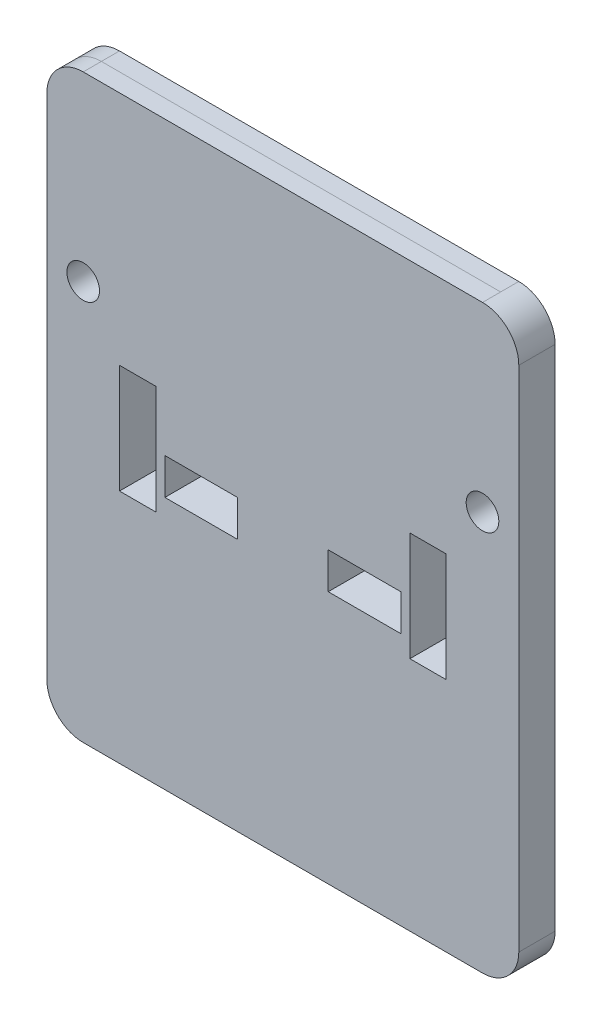
ISO-10303-21;
HEADER;
FILE_DESCRIPTION(('STEP AP214'),'2;1');
FILE_NAME('part.step','',(''),(''),'','','');
FILE_SCHEMA(('AUTOMOTIVE_DESIGN { 1 0 10303 214 1 1 1 1 }'));
ENDSEC;
DATA;
#1=APPLICATION_CONTEXT('core data for automotive mechanical design processes');
#2=APPLICATION_PROTOCOL_DEFINITION('international standard','automotive_design',2000,#1);
#3=PRODUCT_CONTEXT('',#1,'mechanical');
#4=PRODUCT('Part','Part','',(#3));
#5=PRODUCT_RELATED_PRODUCT_CATEGORY('part','',(#4));
#6=PRODUCT_DEFINITION_FORMATION('','',#4);
#7=PRODUCT_DEFINITION_CONTEXT('part definition',#1,'design');
#8=PRODUCT_DEFINITION('design','',#6,#7);
#9=PRODUCT_DEFINITION_SHAPE('','',#8);
#10=(LENGTH_UNIT() NAMED_UNIT(*) SI_UNIT(.MILLI.,.METRE.));
#11=(NAMED_UNIT(*) PLANE_ANGLE_UNIT() SI_UNIT($,.RADIAN.));
#12=(NAMED_UNIT(*) SI_UNIT($,.STERADIAN.) SOLID_ANGLE_UNIT());
#13=UNCERTAINTY_MEASURE_WITH_UNIT(LENGTH_MEASURE(1.E-05),#10,'distance_accuracy_value','');
#14=(GEOMETRIC_REPRESENTATION_CONTEXT(3) GLOBAL_UNCERTAINTY_ASSIGNED_CONTEXT((#13)) GLOBAL_UNIT_ASSIGNED_CONTEXT((#10,
#11,#12)) REPRESENTATION_CONTEXT('',''));
#15=CARTESIAN_POINT('',(0.,0.,0.));
#16=DIRECTION('',(0.,0.,1.));
#17=DIRECTION('',(1.,0.,0.));
#18=AXIS2_PLACEMENT_3D('',#15,#16,#17);
#19=CARTESIAN_POINT('',(-139.7,177.8,25.4));
#20=DIRECTION('',(0.,0.,-1.));
#21=DIRECTION('',(-1.,0.,0.));
#22=AXIS2_PLACEMENT_3D('',#19,#20,#21);
#23=CYLINDRICAL_SURFACE('',#22,25.4);
#24=DIRECTION('',(0.,0.,-1.));
#25=VECTOR('',#24,1.);
#26=CARTESIAN_POINT('',(-139.7,203.2,25.4));
#27=LINE('',#26,#25);
#28=CARTESIAN_POINT('',(-139.7,203.2,25.4));
#29=VERTEX_POINT('',#28);
#30=CARTESIAN_POINT('',(-139.7,203.2,12.7));
#31=VERTEX_POINT('',#30);
#32=EDGE_CURVE('E416',#29,#31,#27,.T.);
#33=ORIENTED_EDGE('',*,*,#32,.T.);
#34=CARTESIAN_POINT('',(-139.7,177.8,12.7));
#35=DIRECTION('',(0.,0.,1.));
#36=DIRECTION('',(1.,0.,0.));
#37=AXIS2_PLACEMENT_3D('',#34,#35,#36);
#38=CIRCLE('',#37,25.4);
#39=CARTESIAN_POINT('',(-165.1,177.8,12.7));
#40=VERTEX_POINT('',#39);
#41=EDGE_CURVE('E12',#31,#40,#38,.T.);
#42=ORIENTED_EDGE('',*,*,#41,.T.);
#43=DIRECTION('',(0.,0.,-1.));
#44=VECTOR('',#43,1.);
#45=CARTESIAN_POINT('',(-165.1,177.8,25.4));
#46=LINE('',#45,#44);
#47=CARTESIAN_POINT('',(-165.1,177.8,25.4));
#48=VERTEX_POINT('',#47);
#49=EDGE_CURVE('E412',#48,#40,#46,.T.);
#50=ORIENTED_EDGE('',*,*,#49,.F.);
#51=CARTESIAN_POINT('',(-139.7,177.8,25.4));
#52=DIRECTION('',(0.,0.,1.));
#53=DIRECTION('',(-1.,0.,0.));
#54=AXIS2_PLACEMENT_3D('',#51,#52,#53);
#55=CIRCLE('',#54,25.4);
#56=EDGE_CURVE('E383',#29,#48,#55,.T.);
#57=ORIENTED_EDGE('',*,*,#56,.F.);
#58=EDGE_LOOP('',(#33,#42,#50,#57));
#59=FACE_BOUND('',#58,.T.);
#60=ADVANCED_FACE('F44',(#59),#23,.T.);
#61=CARTESIAN_POINT('',(-165.1,-177.8,25.4));
#62=DIRECTION('',(1.,0.,0.));
#63=DIRECTION('',(0.,0.,-1.));
#64=AXIS2_PLACEMENT_3D('',#61,#62,#63);
#65=PLANE('',#64);
#66=ORIENTED_EDGE('',*,*,#49,.T.);
#67=DIRECTION('',(0.,-1.,0.));
#68=VECTOR('',#67,1.);
#69=CARTESIAN_POINT('',(-165.1,-177.8,12.7));
#70=LINE('',#69,#68);
#71=CARTESIAN_POINT('',(-165.1,-177.8,12.7));
#72=VERTEX_POINT('',#71);
#73=EDGE_CURVE('E52',#40,#72,#70,.T.);
#74=ORIENTED_EDGE('',*,*,#73,.T.);
#75=DIRECTION('',(0.,0.,-1.));
#76=VECTOR('',#75,1.);
#77=CARTESIAN_POINT('',(-165.1,-177.8,25.4));
#78=LINE('',#77,#76);
#79=CARTESIAN_POINT('',(-165.1,-177.8,25.4));
#80=VERTEX_POINT('',#79);
#81=EDGE_CURVE('E408',#80,#72,#78,.T.);
#82=ORIENTED_EDGE('',*,*,#81,.F.);
#83=DIRECTION('',(0.,-1.,0.));
#84=VECTOR('',#83,1.);
#85=CARTESIAN_POINT('',(-165.1,-177.8,25.4));
#86=LINE('',#85,#84);
#87=EDGE_CURVE('E385',#48,#80,#86,.T.);
#88=ORIENTED_EDGE('',*,*,#87,.F.);
#89=EDGE_LOOP('',(#66,#74,#82,#88));
#90=FACE_BOUND('',#89,.T.);
#91=ADVANCED_FACE('F447',(#90),#65,.F.);
#92=CARTESIAN_POINT('',(-139.7,-177.8,25.4));
#93=DIRECTION('',(0.,0.,-1.));
#94=DIRECTION('',(-1.,0.,0.));
#95=AXIS2_PLACEMENT_3D('',#92,#93,#94);
#96=CYLINDRICAL_SURFACE('',#95,25.4);
#97=ORIENTED_EDGE('',*,*,#81,.T.);
#98=CARTESIAN_POINT('',(-139.7,-177.8,12.7));
#99=DIRECTION('',(0.,0.,1.));
#100=DIRECTION('',(1.,0.,0.));
#101=AXIS2_PLACEMENT_3D('',#98,#99,#100);
#102=CIRCLE('',#101,25.4);
#103=CARTESIAN_POINT('',(-139.7,-203.2,12.7));
#104=VERTEX_POINT('',#103);
#105=EDGE_CURVE('E442',#72,#104,#102,.T.);
#106=ORIENTED_EDGE('',*,*,#105,.T.);
#107=DIRECTION('',(0.,0.,-1.));
#108=VECTOR('',#107,1.);
#109=CARTESIAN_POINT('',(-139.7,-203.2,25.4));
#110=LINE('',#109,#108);
#111=CARTESIAN_POINT('',(-139.7,-203.2,25.4));
#112=VERTEX_POINT('',#111);
#113=EDGE_CURVE('E434',#112,#104,#110,.T.);
#114=ORIENTED_EDGE('',*,*,#113,.F.);
#115=CARTESIAN_POINT('',(-139.7,-177.8,25.4));
#116=DIRECTION('',(0.,0.,1.));
#117=DIRECTION('',(-1.,0.,0.));
#118=AXIS2_PLACEMENT_3D('',#115,#116,#117);
#119=CIRCLE('',#118,25.4);
#120=EDGE_CURVE('E369',#80,#112,#119,.T.);
#121=ORIENTED_EDGE('',*,*,#120,.F.);
#122=EDGE_LOOP('',(#97,#106,#114,#121));
#123=FACE_BOUND('',#122,.T.);
#124=ADVANCED_FACE('F462',(#123),#96,.T.);
#125=CARTESIAN_POINT('',(-139.7,203.2,25.4));
#126=DIRECTION('',(0.,-1.,0.));
#127=DIRECTION('',(0.,0.,-1.));
#128=AXIS2_PLACEMENT_3D('',#125,#126,#127);
#129=PLANE('',#128);
#130=DIRECTION('',(0.,0.,-1.));
#131=VECTOR('',#130,1.);
#132=CARTESIAN_POINT('',(139.7,203.2,25.4));
#133=LINE('',#132,#131);
#134=CARTESIAN_POINT('',(139.7,203.2,25.4));
#135=VERTEX_POINT('',#134);
#136=CARTESIAN_POINT('',(139.7,203.2,12.7));
#137=VERTEX_POINT('',#136);
#138=EDGE_CURVE('E420',#135,#137,#133,.T.);
#139=ORIENTED_EDGE('',*,*,#138,.T.);
#140=DIRECTION('',(-1.,0.,0.));
#141=VECTOR('',#140,1.);
#142=CARTESIAN_POINT('',(-139.7,203.2,12.7));
#143=LINE('',#142,#141);
#144=EDGE_CURVE('E439',#137,#31,#143,.T.);
#145=ORIENTED_EDGE('',*,*,#144,.T.);
#146=ORIENTED_EDGE('',*,*,#32,.F.);
#147=DIRECTION('',(-1.,0.,0.));
#148=VECTOR('',#147,1.);
#149=CARTESIAN_POINT('',(-139.7,203.2,25.4));
#150=LINE('',#149,#148);
#151=EDGE_CURVE('E381',#135,#29,#150,.T.);
#152=ORIENTED_EDGE('',*,*,#151,.F.);
#153=EDGE_LOOP('',(#139,#145,#146,#152));
#154=FACE_BOUND('',#153,.T.);
#155=ADVANCED_FACE('F474',(#154),#129,.F.);
#156=CARTESIAN_POINT('',(-139.7,-203.2,25.4));
#157=DIRECTION('',(0.,1.,0.));
#158=DIRECTION('',(0.,0.,1.));
#159=AXIS2_PLACEMENT_3D('',#156,#157,#158);
#160=PLANE('',#159);
#161=ORIENTED_EDGE('',*,*,#113,.T.);
#162=DIRECTION('',(1.,0.,0.));
#163=VECTOR('',#162,1.);
#164=CARTESIAN_POINT('',(-139.7,-203.2,12.7));
#165=LINE('',#164,#163);
#166=CARTESIAN_POINT('',(139.7,-203.2,12.7));
#167=VERTEX_POINT('',#166);
#168=EDGE_CURVE('E437',#104,#167,#165,.T.);
#169=ORIENTED_EDGE('',*,*,#168,.T.);
#170=DIRECTION('',(0.,0.,-1.));
#171=VECTOR('',#170,1.);
#172=CARTESIAN_POINT('',(139.7,-203.2,25.4));
#173=LINE('',#172,#171);
#174=CARTESIAN_POINT('',(139.7,-203.2,25.4));
#175=VERTEX_POINT('',#174);
#176=EDGE_CURVE('E430',#175,#167,#173,.T.);
#177=ORIENTED_EDGE('',*,*,#176,.F.);
#178=DIRECTION('',(1.,0.,0.));
#179=VECTOR('',#178,1.);
#180=CARTESIAN_POINT('',(-139.7,-203.2,25.4));
#181=LINE('',#180,#179);
#182=EDGE_CURVE('E372',#112,#175,#181,.T.);
#183=ORIENTED_EDGE('',*,*,#182,.F.);
#184=EDGE_LOOP('',(#161,#169,#177,#183));
#185=FACE_BOUND('',#184,.T.);
#186=ADVANCED_FACE('F492',(#185),#160,.F.);
#187=CARTESIAN_POINT('',(-139.7,-177.8,25.4));
#188=DIRECTION('',(0.,0.,-1.));
#189=DIRECTION('',(-1.,0.,0.));
#190=AXIS2_PLACEMENT_3D('',#187,#188,#189);
#191=PLANE('',#190);
#192=DIRECTION('',(0.,-1.,0.));
#193=VECTOR('',#192,1.);
#194=CARTESIAN_POINT('',(114.3,38.0999999999996,25.4));
#195=LINE('',#194,#193);
#196=CARTESIAN_POINT('',(114.3,38.0999999999996,25.4));
#197=VERTEX_POINT('',#196);
#198=CARTESIAN_POINT('',(114.3,-38.1000000000004,25.4));
#199=VERTEX_POINT('',#198);
#200=EDGE_CURVE('E234',#197,#199,#195,.T.);
#201=ORIENTED_EDGE('',*,*,#200,.T.);
#202=DIRECTION('',(-1.,0.,0.));
#203=VECTOR('',#202,1.);
#204=CARTESIAN_POINT('',(114.3,-38.1000000000004,25.4));
#205=LINE('',#204,#203);
#206=CARTESIAN_POINT('',(88.9,-38.1000000000004,25.4));
#207=VERTEX_POINT('',#206);
#208=EDGE_CURVE('E226',#199,#207,#205,.T.);
#209=ORIENTED_EDGE('',*,*,#208,.T.);
#210=DIRECTION('',(0.,1.,0.));
#211=VECTOR('',#210,1.);
#212=CARTESIAN_POINT('',(88.9,-38.1000000000004,25.4));
#213=LINE('',#212,#211);
#214=CARTESIAN_POINT('',(88.9,38.0999999999996,25.4));
#215=VERTEX_POINT('',#214);
#216=EDGE_CURVE('E237',#207,#215,#213,.T.);
#217=ORIENTED_EDGE('',*,*,#216,.T.);
#218=DIRECTION('',(1.,0.,0.));
#219=VECTOR('',#218,1.);
#220=CARTESIAN_POINT('',(88.9,38.0999999999996,25.4));
#221=LINE('',#220,#219);
#222=EDGE_CURVE('E59',#215,#197,#221,.T.);
#223=ORIENTED_EDGE('',*,*,#222,.T.);
#224=EDGE_LOOP('',(#201,#209,#217,#223));
#225=FACE_BOUND('',#224,.T.);
#226=DIRECTION('',(0.,-1.,0.));
#227=VECTOR('',#226,1.);
#228=CARTESIAN_POINT('',(-88.9,38.0999999999999,25.4));
#229=LINE('',#228,#227);
#230=CARTESIAN_POINT('',(-88.9,38.0999999999999,25.4));
#231=VERTEX_POINT('',#230);
#232=CARTESIAN_POINT('',(-88.9,-38.1000000000002,25.4));
#233=VERTEX_POINT('',#232);
#234=EDGE_CURVE('E267',#231,#233,#229,.T.);
#235=ORIENTED_EDGE('',*,*,#234,.T.);
#236=DIRECTION('',(-1.,0.,0.));
#237=VECTOR('',#236,1.);
#238=CARTESIAN_POINT('',(-88.9,-38.1000000000002,25.4));
#239=LINE('',#238,#237);
#240=CARTESIAN_POINT('',(-114.3,-38.1000000000002,25.4));
#241=VERTEX_POINT('',#240);
#242=EDGE_CURVE('E278',#233,#241,#239,.T.);
#243=ORIENTED_EDGE('',*,*,#242,.T.);
#244=DIRECTION('',(0.,1.,0.));
#245=VECTOR('',#244,1.);
#246=CARTESIAN_POINT('',(-114.3,-38.1000000000002,25.4));
#247=LINE('',#246,#245);
#248=CARTESIAN_POINT('',(-114.3,38.0999999999999,25.4));
#249=VERTEX_POINT('',#248);
#250=EDGE_CURVE('E288',#241,#249,#247,.T.);
#251=ORIENTED_EDGE('',*,*,#250,.T.);
#252=DIRECTION('',(1.,0.,0.));
#253=VECTOR('',#252,1.);
#254=CARTESIAN_POINT('',(-114.3,38.0999999999999,25.4));
#255=LINE('',#254,#253);
#256=EDGE_CURVE('E67',#249,#231,#255,.T.);
#257=ORIENTED_EDGE('',*,*,#256,.T.);
#258=EDGE_LOOP('',(#235,#243,#251,#257));
#259=FACE_BOUND('',#258,.T.);
#260=DIRECTION('',(1.,0.,0.));
#261=VECTOR('',#260,1.);
#262=CARTESIAN_POINT('',(31.75,-0.689923182000014,25.4));
#263=LINE('',#262,#261);
#264=CARTESIAN_POINT('',(31.75,-0.689923182000014,25.4));
#265=VERTEX_POINT('',#264);
#266=CARTESIAN_POINT('',(82.55,-0.689923182000014,25.4));
#267=VERTEX_POINT('',#266);
#268=EDGE_CURVE('E303',#265,#267,#263,.T.);
#269=ORIENTED_EDGE('',*,*,#268,.T.);
#270=DIRECTION('',(0.,-1.,0.));
#271=VECTOR('',#270,1.);
#272=CARTESIAN_POINT('',(82.55,-0.689923182000014,25.4));
#273=LINE('',#272,#271);
#274=CARTESIAN_POINT('',(82.55,-26.089923182,25.4));
#275=VERTEX_POINT('',#274);
#276=EDGE_CURVE('E293',#267,#275,#273,.T.);
#277=ORIENTED_EDGE('',*,*,#276,.T.);
#278=DIRECTION('',(-1.,0.,0.));
#279=VECTOR('',#278,1.);
#280=CARTESIAN_POINT('',(82.55,-26.089923182,25.4));
#281=LINE('',#280,#279);
#282=CARTESIAN_POINT('',(31.75,-26.089923182,25.4));
#283=VERTEX_POINT('',#282);
#284=EDGE_CURVE('E296',#275,#283,#281,.T.);
#285=ORIENTED_EDGE('',*,*,#284,.T.);
#286=DIRECTION('',(0.,1.,0.));
#287=VECTOR('',#286,1.);
#288=CARTESIAN_POINT('',(31.75,-26.089923182,25.4));
#289=LINE('',#288,#287);
#290=EDGE_CURVE('E300',#283,#265,#289,.T.);
#291=ORIENTED_EDGE('',*,*,#290,.T.);
#292=EDGE_LOOP('',(#269,#277,#285,#291));
#293=FACE_BOUND('',#292,.T.);
#294=DIRECTION('',(1.,0.,0.));
#295=VECTOR('',#294,1.);
#296=CARTESIAN_POINT('',(-82.55,-0.689923182000014,25.4));
#297=LINE('',#296,#295);
#298=CARTESIAN_POINT('',(-82.55,-0.689923182000014,25.4));
#299=VERTEX_POINT('',#298);
#300=CARTESIAN_POINT('',(-31.75,-0.689923182000014,25.4));
#301=VERTEX_POINT('',#300);
#302=EDGE_CURVE('E330',#299,#301,#297,.T.);
#303=ORIENTED_EDGE('',*,*,#302,.T.);
#304=DIRECTION('',(0.,-1.,0.));
#305=VECTOR('',#304,1.);
#306=CARTESIAN_POINT('',(-31.75,-0.689923182000014,25.4));
#307=LINE('',#306,#305);
#308=CARTESIAN_POINT('',(-31.75,-26.089923182,25.4));
#309=VERTEX_POINT('',#308);
#310=EDGE_CURVE('E340',#301,#309,#307,.T.);
#311=ORIENTED_EDGE('',*,*,#310,.T.);
#312=DIRECTION('',(-1.,0.,0.));
#313=VECTOR('',#312,1.);
#314=CARTESIAN_POINT('',(-31.75,-26.089923182,25.4));
#315=LINE('',#314,#313);
#316=CARTESIAN_POINT('',(-82.55,-26.089923182,25.4));
#317=VERTEX_POINT('',#316);
#318=EDGE_CURVE('E352',#309,#317,#315,.T.);
#319=ORIENTED_EDGE('',*,*,#318,.T.);
#320=DIRECTION('',(0.,1.,0.));
#321=VECTOR('',#320,1.);
#322=CARTESIAN_POINT('',(-82.55,-26.089923182,25.4));
#323=LINE('',#322,#321);
#324=EDGE_CURVE('E349',#317,#299,#323,.T.);
#325=ORIENTED_EDGE('',*,*,#324,.T.);
#326=EDGE_LOOP('',(#303,#311,#319,#325));
#327=FACE_BOUND('',#326,.T.);
#328=ORIENTED_EDGE('',*,*,#120,.T.);
#329=ORIENTED_EDGE('',*,*,#182,.T.);
#330=CARTESIAN_POINT('',(139.7,-177.8,25.4));
#331=DIRECTION('',(0.,0.,1.));
#332=DIRECTION('',(1.,0.,0.));
#333=AXIS2_PLACEMENT_3D('',#330,#331,#332);
#334=CIRCLE('',#333,25.4);
#335=CARTESIAN_POINT('',(165.1,-177.8,25.4));
#336=VERTEX_POINT('',#335);
#337=EDGE_CURVE('E375',#175,#336,#334,.T.);
#338=ORIENTED_EDGE('',*,*,#337,.T.);
#339=DIRECTION('',(0.,1.,0.));
#340=VECTOR('',#339,1.);
#341=CARTESIAN_POINT('',(165.1,-177.8,25.4));
#342=LINE('',#341,#340);
#343=CARTESIAN_POINT('',(165.1,177.8,25.4));
#344=VERTEX_POINT('',#343);
#345=EDGE_CURVE('E377',#336,#344,#342,.T.);
#346=ORIENTED_EDGE('',*,*,#345,.T.);
#347=CARTESIAN_POINT('',(139.7,177.8,25.4));
#348=DIRECTION('',(0.,0.,1.));
#349=DIRECTION('',(-1.,0.,0.));
#350=AXIS2_PLACEMENT_3D('',#347,#348,#349);
#351=CIRCLE('',#350,25.4);
#352=EDGE_CURVE('E379',#344,#135,#351,.T.);
#353=ORIENTED_EDGE('',*,*,#352,.T.);
#354=ORIENTED_EDGE('',*,*,#151,.T.);
#355=ORIENTED_EDGE('',*,*,#56,.T.);
#356=ORIENTED_EDGE('',*,*,#87,.T.);
#357=EDGE_LOOP('',(#328,#329,#338,#346,#353,#354,#355,#356));
#358=FACE_BOUND('',#357,.T.);
#359=CARTESIAN_POINT('',(-139.7,76.2,25.4));
#360=DIRECTION('',(0.,0.,1.));
#361=DIRECTION('',(1.,0.,0.));
#362=AXIS2_PLACEMENT_3D('',#359,#360,#361);
#363=CIRCLE('',#362,11.422);
#364=CARTESIAN_POINT('',(-128.278,76.2,25.4));
#365=VERTEX_POINT('',#364);
#366=EDGE_CURVE('E363',#365,#365,#363,.T.);
#367=ORIENTED_EDGE('',*,*,#366,.F.);
#368=EDGE_LOOP('',(#367));
#369=FACE_BOUND('',#368,.T.);
#370=CARTESIAN_POINT('',(139.7,76.2,25.4));
#371=DIRECTION('',(0.,0.,1.));
#372=DIRECTION('',(1.,0.,0.));
#373=AXIS2_PLACEMENT_3D('',#370,#371,#372);
#374=CIRCLE('',#373,11.422);
#375=CARTESIAN_POINT('',(151.122,76.2,25.4));
#376=VERTEX_POINT('',#375);
#377=EDGE_CURVE('E357',#376,#376,#374,.T.);
#378=ORIENTED_EDGE('',*,*,#377,.F.);
#379=EDGE_LOOP('',(#378));
#380=FACE_BOUND('',#379,.T.);
#381=ADVANCED_FACE('F241',(#225,#259,#293,#327,#358,#369,#380),#191,.F.);
#382=CARTESIAN_POINT('',(-139.7,-177.8,0.));
#383=DIRECTION('',(0.,0.,-1.));
#384=DIRECTION('',(-1.,0.,0.));
#385=AXIS2_PLACEMENT_3D('',#382,#383,#384);
#386=PLANE('',#385);
#387=DIRECTION('',(-1.,0.,0.));
#388=VECTOR('',#387,1.);
#389=CARTESIAN_POINT('',(114.3,-38.1000000000004,0.));
#390=LINE('',#389,#388);
#391=CARTESIAN_POINT('',(114.3,-38.1000000000004,0.));
#392=VERTEX_POINT('',#391);
#393=CARTESIAN_POINT('',(88.9,-38.1000000000004,0.));
#394=VERTEX_POINT('',#393);
#395=EDGE_CURVE('E229',#392,#394,#390,.T.);
#396=ORIENTED_EDGE('',*,*,#395,.F.);
#397=DIRECTION('',(0.,-1.,0.));
#398=VECTOR('',#397,1.);
#399=CARTESIAN_POINT('',(114.3,38.0999999999996,0.));
#400=LINE('',#399,#398);
#401=CARTESIAN_POINT('',(114.3,38.0999999999996,0.));
#402=VERTEX_POINT('',#401);
#403=EDGE_CURVE('E244',#402,#392,#400,.T.);
#404=ORIENTED_EDGE('',*,*,#403,.F.);
#405=DIRECTION('',(1.,0.,0.));
#406=VECTOR('',#405,1.);
#407=CARTESIAN_POINT('',(88.9,38.0999999999996,0.));
#408=LINE('',#407,#406);
#409=CARTESIAN_POINT('',(88.9,38.0999999999996,0.));
#410=VERTEX_POINT('',#409);
#411=EDGE_CURVE('E247',#410,#402,#408,.T.);
#412=ORIENTED_EDGE('',*,*,#411,.F.);
#413=DIRECTION('',(0.,1.,0.));
#414=VECTOR('',#413,1.);
#415=CARTESIAN_POINT('',(88.9,-38.1000000000004,0.));
#416=LINE('',#415,#414);
#417=EDGE_CURVE('E253',#394,#410,#416,.T.);
#418=ORIENTED_EDGE('',*,*,#417,.F.);
#419=EDGE_LOOP('',(#396,#404,#412,#418));
#420=FACE_BOUND('',#419,.T.);
#421=DIRECTION('',(-1.,0.,0.));
#422=VECTOR('',#421,1.);
#423=CARTESIAN_POINT('',(-88.9,-38.1000000000002,0.));
#424=LINE('',#423,#422);
#425=CARTESIAN_POINT('',(-88.9,-38.1000000000002,0.));
#426=VERTEX_POINT('',#425);
#427=CARTESIAN_POINT('',(-114.3,-38.1000000000002,0.));
#428=VERTEX_POINT('',#427);
#429=EDGE_CURVE('E254',#426,#428,#424,.T.);
#430=ORIENTED_EDGE('',*,*,#429,.F.);
#431=DIRECTION('',(0.,-1.,0.));
#432=VECTOR('',#431,1.);
#433=CARTESIAN_POINT('',(-88.9,38.0999999999999,0.));
#434=LINE('',#433,#432);
#435=CARTESIAN_POINT('',(-88.9,38.0999999999999,0.));
#436=VERTEX_POINT('',#435);
#437=EDGE_CURVE('E274',#436,#426,#434,.T.);
#438=ORIENTED_EDGE('',*,*,#437,.F.);
#439=DIRECTION('',(1.,0.,0.));
#440=VECTOR('',#439,1.);
#441=CARTESIAN_POINT('',(-114.3,38.0999999999999,0.));
#442=LINE('',#441,#440);
#443=CARTESIAN_POINT('',(-114.3,38.0999999999999,0.));
#444=VERTEX_POINT('',#443);
#445=EDGE_CURVE('E277',#444,#436,#442,.T.);
#446=ORIENTED_EDGE('',*,*,#445,.F.);
#447=DIRECTION('',(0.,1.,0.));
#448=VECTOR('',#447,1.);
#449=CARTESIAN_POINT('',(-114.3,-38.1000000000002,0.));
#450=LINE('',#449,#448);
#451=EDGE_CURVE('E281',#428,#444,#450,.T.);
#452=ORIENTED_EDGE('',*,*,#451,.F.);
#453=EDGE_LOOP('',(#430,#438,#446,#452));
#454=FACE_BOUND('',#453,.T.);
#455=DIRECTION('',(0.,-1.,0.));
#456=VECTOR('',#455,1.);
#457=CARTESIAN_POINT('',(82.55,-0.689923182000014,0.));
#458=LINE('',#457,#456);
#459=CARTESIAN_POINT('',(82.55,-0.689923182000014,0.));
#460=VERTEX_POINT('',#459);
#461=CARTESIAN_POINT('',(82.55,-26.089923182,0.));
#462=VERTEX_POINT('',#461);
#463=EDGE_CURVE('E307',#460,#462,#458,.T.);
#464=ORIENTED_EDGE('',*,*,#463,.F.);
#465=DIRECTION('',(1.,0.,0.));
#466=VECTOR('',#465,1.);
#467=CARTESIAN_POINT('',(31.75,-0.689923182000014,0.));
#468=LINE('',#467,#466);
#469=CARTESIAN_POINT('',(31.75,-0.689923182000014,0.));
#470=VERTEX_POINT('',#469);
#471=EDGE_CURVE('E297',#470,#460,#468,.T.);
#472=ORIENTED_EDGE('',*,*,#471,.F.);
#473=DIRECTION('',(0.,1.,0.));
#474=VECTOR('',#473,1.);
#475=CARTESIAN_POINT('',(31.75,-26.089923182,0.));
#476=LINE('',#475,#474);
#477=CARTESIAN_POINT('',(31.75,-26.089923182,0.));
#478=VERTEX_POINT('',#477);
#479=EDGE_CURVE('E313',#478,#470,#476,.T.);
#480=ORIENTED_EDGE('',*,*,#479,.F.);
#481=DIRECTION('',(-1.,0.,0.));
#482=VECTOR('',#481,1.);
#483=CARTESIAN_POINT('',(82.55,-26.089923182,0.));
#484=LINE('',#483,#482);
#485=EDGE_CURVE('E309',#462,#478,#484,.T.);
#486=ORIENTED_EDGE('',*,*,#485,.F.);
#487=EDGE_LOOP('',(#464,#472,#480,#486));
#488=FACE_BOUND('',#487,.T.);
#489=DIRECTION('',(0.,-1.,0.));
#490=VECTOR('',#489,1.);
#491=CARTESIAN_POINT('',(-31.75,-0.689923182000014,0.));
#492=LINE('',#491,#490);
#493=CARTESIAN_POINT('',(-31.75,-0.689923182000014,0.));
#494=VERTEX_POINT('',#493);
#495=CARTESIAN_POINT('',(-31.75,-26.089923182,0.));
#496=VERTEX_POINT('',#495);
#497=EDGE_CURVE('E310',#494,#496,#492,.T.);
#498=ORIENTED_EDGE('',*,*,#497,.F.);
#499=DIRECTION('',(1.,0.,0.));
#500=VECTOR('',#499,1.);
#501=CARTESIAN_POINT('',(-82.55,-0.689923182000014,0.));
#502=LINE('',#501,#500);
#503=CARTESIAN_POINT('',(-82.55,-0.689923182000014,0.));
#504=VERTEX_POINT('',#503);
#505=EDGE_CURVE('E336',#504,#494,#502,.T.);
#506=ORIENTED_EDGE('',*,*,#505,.F.);
#507=DIRECTION('',(0.,1.,0.));
#508=VECTOR('',#507,1.);
#509=CARTESIAN_POINT('',(-82.55,-26.089923182,0.));
#510=LINE('',#509,#508);
#511=CARTESIAN_POINT('',(-82.55,-26.089923182,0.));
#512=VERTEX_POINT('',#511);
#513=EDGE_CURVE('E339',#512,#504,#510,.T.);
#514=ORIENTED_EDGE('',*,*,#513,.F.);
#515=DIRECTION('',(-1.,0.,0.));
#516=VECTOR('',#515,1.);
#517=CARTESIAN_POINT('',(-31.75,-26.089923182,0.));
#518=LINE('',#517,#516);
#519=EDGE_CURVE('E343',#496,#512,#518,.T.);
#520=ORIENTED_EDGE('',*,*,#519,.F.);
#521=EDGE_LOOP('',(#498,#506,#514,#520));
#522=FACE_BOUND('',#521,.T.);
#523=CARTESIAN_POINT('',(-139.7,76.2,0.));
#524=DIRECTION('',(0.,0.,1.));
#525=DIRECTION('',(1.,0.,0.));
#526=AXIS2_PLACEMENT_3D('',#523,#524,#525);
#527=CIRCLE('',#526,11.422);
#528=CARTESIAN_POINT('',(-128.278,76.2,0.));
#529=VERTEX_POINT('',#528);
#530=EDGE_CURVE('E360',#529,#529,#527,.T.);
#531=ORIENTED_EDGE('',*,*,#530,.T.);
#532=EDGE_LOOP('',(#531));
#533=FACE_BOUND('',#532,.T.);
#534=CARTESIAN_POINT('',(-139.7,-177.8,0.));
#535=DIRECTION('',(0.,0.,1.));
#536=DIRECTION('',(-1.,0.,0.));
#537=AXIS2_PLACEMENT_3D('',#534,#535,#536);
#538=CIRCLE('',#537,25.4);
#539=CARTESIAN_POINT('',(-165.1,-177.8,0.));
#540=VERTEX_POINT('',#539);
#541=CARTESIAN_POINT('',(-139.7,-203.2,0.));
#542=VERTEX_POINT('',#541);
#543=EDGE_CURVE('E366',#540,#542,#538,.T.);
#544=ORIENTED_EDGE('',*,*,#543,.F.);
#545=DIRECTION('',(0.,-1.,0.));
#546=VECTOR('',#545,1.);
#547=CARTESIAN_POINT('',(-165.1,-177.8,0.));
#548=LINE('',#547,#546);
#549=CARTESIAN_POINT('',(-165.1,177.8,0.));
#550=VERTEX_POINT('',#549);
#551=EDGE_CURVE('E373',#550,#540,#548,.T.);
#552=ORIENTED_EDGE('',*,*,#551,.F.);
#553=CARTESIAN_POINT('',(-139.7,177.8,0.));
#554=DIRECTION('',(0.,0.,1.));
#555=DIRECTION('',(-1.,0.,0.));
#556=AXIS2_PLACEMENT_3D('',#553,#554,#555);
#557=CIRCLE('',#556,25.4);
#558=CARTESIAN_POINT('',(-139.7,203.2,0.));
#559=VERTEX_POINT('',#558);
#560=EDGE_CURVE('E403',#559,#550,#557,.T.);
#561=ORIENTED_EDGE('',*,*,#560,.F.);
#562=DIRECTION('',(-1.,0.,0.));
#563=VECTOR('',#562,1.);
#564=CARTESIAN_POINT('',(-139.7,203.2,0.));
#565=LINE('',#564,#563);
#566=CARTESIAN_POINT('',(139.7,203.2,0.));
#567=VERTEX_POINT('',#566);
#568=EDGE_CURVE('E400',#567,#559,#565,.T.);
#569=ORIENTED_EDGE('',*,*,#568,.F.);
#570=CARTESIAN_POINT('',(139.7,177.8,0.));
#571=DIRECTION('',(0.,0.,1.));
#572=DIRECTION('',(-1.,0.,0.));
#573=AXIS2_PLACEMENT_3D('',#570,#571,#572);
#574=CIRCLE('',#573,25.4);
#575=CARTESIAN_POINT('',(165.1,177.8,0.));
#576=VERTEX_POINT('',#575);
#577=EDGE_CURVE('E397',#576,#567,#574,.T.);
#578=ORIENTED_EDGE('',*,*,#577,.F.);
#579=DIRECTION('',(0.,1.,0.));
#580=VECTOR('',#579,1.);
#581=CARTESIAN_POINT('',(165.1,-177.8,0.));
#582=LINE('',#581,#580);
#583=CARTESIAN_POINT('',(165.1,-177.8,0.));
#584=VERTEX_POINT('',#583);
#585=EDGE_CURVE('E395',#584,#576,#582,.T.);
#586=ORIENTED_EDGE('',*,*,#585,.F.);
#587=CARTESIAN_POINT('',(139.7,-177.8,0.));
#588=DIRECTION('',(0.,0.,1.));
#589=DIRECTION('',(1.,0.,0.));
#590=AXIS2_PLACEMENT_3D('',#587,#588,#589);
#591=CIRCLE('',#590,25.4);
#592=CARTESIAN_POINT('',(139.7,-203.2,0.));
#593=VERTEX_POINT('',#592);
#594=EDGE_CURVE('E393',#593,#584,#591,.T.);
#595=ORIENTED_EDGE('',*,*,#594,.F.);
#596=DIRECTION('',(1.,0.,0.));
#597=VECTOR('',#596,1.);
#598=CARTESIAN_POINT('',(-139.7,-203.2,0.));
#599=LINE('',#598,#597);
#600=EDGE_CURVE('E390',#542,#593,#599,.T.);
#601=ORIENTED_EDGE('',*,*,#600,.F.);
#602=EDGE_LOOP('',(#544,#552,#561,#569,#578,#586,#595,#601));
#603=FACE_BOUND('',#602,.T.);
#604=CARTESIAN_POINT('',(139.7,76.2,0.));
#605=DIRECTION('',(0.,0.,1.));
#606=DIRECTION('',(1.,0.,0.));
#607=AXIS2_PLACEMENT_3D('',#604,#605,#606);
#608=CIRCLE('',#607,11.422);
#609=CARTESIAN_POINT('',(151.122,76.2,0.));
#610=VERTEX_POINT('',#609);
#611=EDGE_CURVE('E320',#610,#610,#608,.T.);
#612=ORIENTED_EDGE('',*,*,#611,.T.);
#613=EDGE_LOOP('',(#612));
#614=FACE_BOUND('',#613,.T.);
#615=ADVANCED_FACE('F483',(#420,#454,#488,#522,#533,#603,#614),#386,.T.);
#616=ORIENTED_EDGE('',*,*,#105,.F.);
#617=EDGE_CURVE('E387',#72,#540,#78,.T.);
#618=ORIENTED_EDGE('',*,*,#617,.T.);
#619=ORIENTED_EDGE('',*,*,#543,.T.);
#620=EDGE_CURVE('E433',#104,#542,#110,.T.);
#621=ORIENTED_EDGE('',*,*,#620,.F.);
#622=EDGE_LOOP('',(#616,#618,#619,#621));
#623=FACE_BOUND('',#622,.T.);
#624=ADVANCED_FACE('F46',(#623),#96,.T.);
#625=ORIENTED_EDGE('',*,*,#168,.F.);
#626=ORIENTED_EDGE('',*,*,#620,.T.);
#627=ORIENTED_EDGE('',*,*,#600,.T.);
#628=EDGE_CURVE('E429',#167,#593,#173,.T.);
#629=ORIENTED_EDGE('',*,*,#628,.F.);
#630=EDGE_LOOP('',(#625,#626,#627,#629));
#631=FACE_BOUND('',#630,.T.);
#632=ADVANCED_FACE('F490',(#631),#160,.F.);
#633=CARTESIAN_POINT('',(139.7,-177.8,25.4));
#634=DIRECTION('',(0.,0.,-1.));
#635=DIRECTION('',(-1.,0.,0.));
#636=AXIS2_PLACEMENT_3D('',#633,#634,#635);
#637=CYLINDRICAL_SURFACE('',#636,25.4);
#638=ORIENTED_EDGE('',*,*,#594,.T.);
#639=DIRECTION('',(0.,0.,-1.));
#640=VECTOR('',#639,1.);
#641=CARTESIAN_POINT('',(165.1,-177.8,25.4));
#642=LINE('',#641,#640);
#643=EDGE_CURVE('E426',#336,#584,#642,.T.);
#644=ORIENTED_EDGE('',*,*,#643,.F.);
#645=ORIENTED_EDGE('',*,*,#337,.F.);
#646=ORIENTED_EDGE('',*,*,#176,.T.);
#647=ORIENTED_EDGE('',*,*,#628,.T.);
#648=EDGE_LOOP('',(#638,#644,#645,#646,#647));
#649=FACE_BOUND('',#648,.T.);
#650=ADVANCED_FACE('F496',(#649),#637,.T.);
#651=CARTESIAN_POINT('',(165.1,-177.8,25.4));
#652=DIRECTION('',(-1.,0.,0.));
#653=DIRECTION('',(0.,0.,1.));
#654=AXIS2_PLACEMENT_3D('',#651,#652,#653);
#655=PLANE('',#654);
#656=ORIENTED_EDGE('',*,*,#585,.T.);
#657=DIRECTION('',(0.,0.,-1.));
#658=VECTOR('',#657,1.);
#659=CARTESIAN_POINT('',(165.1,177.8,25.4));
#660=LINE('',#659,#658);
#661=EDGE_CURVE('E423',#344,#576,#660,.T.);
#662=ORIENTED_EDGE('',*,*,#661,.F.);
#663=ORIENTED_EDGE('',*,*,#345,.F.);
#664=ORIENTED_EDGE('',*,*,#643,.T.);
#665=EDGE_LOOP('',(#656,#662,#663,#664));
#666=FACE_BOUND('',#665,.T.);
#667=ADVANCED_FACE('F501',(#666),#655,.F.);
#668=CARTESIAN_POINT('',(139.7,177.8,25.4));
#669=DIRECTION('',(0.,0.,-1.));
#670=DIRECTION('',(-1.,0.,0.));
#671=AXIS2_PLACEMENT_3D('',#668,#669,#670);
#672=CYLINDRICAL_SURFACE('',#671,25.4);
#673=ORIENTED_EDGE('',*,*,#577,.T.);
#674=EDGE_CURVE('E419',#137,#567,#133,.T.);
#675=ORIENTED_EDGE('',*,*,#674,.F.);
#676=ORIENTED_EDGE('',*,*,#138,.F.);
#677=ORIENTED_EDGE('',*,*,#352,.F.);
#678=ORIENTED_EDGE('',*,*,#661,.T.);
#679=EDGE_LOOP('',(#673,#675,#676,#677,#678));
#680=FACE_BOUND('',#679,.T.);
#681=ADVANCED_FACE('F503',(#680),#672,.T.);
#682=ORIENTED_EDGE('',*,*,#144,.F.);
#683=ORIENTED_EDGE('',*,*,#674,.T.);
#684=ORIENTED_EDGE('',*,*,#568,.T.);
#685=EDGE_CURVE('E415',#31,#559,#27,.T.);
#686=ORIENTED_EDGE('',*,*,#685,.F.);
#687=EDGE_LOOP('',(#682,#683,#684,#686));
#688=FACE_BOUND('',#687,.T.);
#689=ADVANCED_FACE('F478',(#688),#129,.F.);
#690=ORIENTED_EDGE('',*,*,#41,.F.);
#691=ORIENTED_EDGE('',*,*,#685,.T.);
#692=ORIENTED_EDGE('',*,*,#560,.T.);
#693=EDGE_CURVE('E411',#40,#550,#46,.T.);
#694=ORIENTED_EDGE('',*,*,#693,.F.);
#695=EDGE_LOOP('',(#690,#691,#692,#694));
#696=FACE_BOUND('',#695,.T.);
#697=ADVANCED_FACE('F471',(#696),#23,.T.);
#698=ORIENTED_EDGE('',*,*,#73,.F.);
#699=ORIENTED_EDGE('',*,*,#693,.T.);
#700=ORIENTED_EDGE('',*,*,#551,.T.);
#701=ORIENTED_EDGE('',*,*,#617,.F.);
#702=EDGE_LOOP('',(#698,#699,#700,#701));
#703=FACE_BOUND('',#702,.T.);
#704=ADVANCED_FACE('F459',(#703),#65,.F.);
#705=CARTESIAN_POINT('',(-139.7,76.2,25.4));
#706=DIRECTION('',(0.,0.,-1.));
#707=DIRECTION('',(-1.,0.,0.));
#708=AXIS2_PLACEMENT_3D('',#705,#706,#707);
#709=CYLINDRICAL_SURFACE('',#708,11.422);
#710=ORIENTED_EDGE('',*,*,#366,.T.);
#711=EDGE_LOOP('',(#710));
#712=FACE_BOUND('',#711,.T.);
#713=ORIENTED_EDGE('',*,*,#530,.F.);
#714=EDGE_LOOP('',(#713));
#715=FACE_BOUND('',#714,.T.);
#716=ADVANCED_FACE('F524',(#712,#715),#709,.F.);
#717=CARTESIAN_POINT('',(139.7,76.2,25.4));
#718=DIRECTION('',(0.,0.,-1.));
#719=DIRECTION('',(-1.,0.,0.));
#720=AXIS2_PLACEMENT_3D('',#717,#718,#719);
#721=CYLINDRICAL_SURFACE('',#720,11.422);
#722=ORIENTED_EDGE('',*,*,#377,.T.);
#723=EDGE_LOOP('',(#722));
#724=FACE_BOUND('',#723,.T.);
#725=ORIENTED_EDGE('',*,*,#611,.F.);
#726=EDGE_LOOP('',(#725));
#727=FACE_BOUND('',#726,.T.);
#728=ADVANCED_FACE('F529',(#724,#727),#721,.F.);
#729=CARTESIAN_POINT('',(-31.75,-0.689923182000014,25.4));
#730=DIRECTION('',(1.,0.,0.));
#731=DIRECTION('',(0.,0.,-1.));
#732=AXIS2_PLACEMENT_3D('',#729,#730,#731);
#733=PLANE('',#732);
#734=ORIENTED_EDGE('',*,*,#497,.T.);
#735=DIRECTION('',(0.,0.,-1.));
#736=VECTOR('',#735,1.);
#737=CARTESIAN_POINT('',(-31.75,-26.089923182,25.4));
#738=LINE('',#737,#736);
#739=EDGE_CURVE('E327',#309,#496,#738,.T.);
#740=ORIENTED_EDGE('',*,*,#739,.F.);
#741=ORIENTED_EDGE('',*,*,#310,.F.);
#742=DIRECTION('',(0.,0.,-1.));
#743=VECTOR('',#742,1.);
#744=CARTESIAN_POINT('',(-31.75,-0.689923182000014,25.4));
#745=LINE('',#744,#743);
#746=EDGE_CURVE('E260',#301,#494,#745,.T.);
#747=ORIENTED_EDGE('',*,*,#746,.T.);
#748=EDGE_LOOP('',(#734,#740,#741,#747));
#749=FACE_BOUND('',#748,.T.);
#750=ADVANCED_FACE('F539',(#749),#733,.F.);
#751=CARTESIAN_POINT('',(-82.55,-0.689923182000014,25.4));
#752=DIRECTION('',(0.,1.,0.));
#753=DIRECTION('',(0.,0.,1.));
#754=AXIS2_PLACEMENT_3D('',#751,#752,#753);
#755=PLANE('',#754);
#756=ORIENTED_EDGE('',*,*,#505,.T.);
#757=ORIENTED_EDGE('',*,*,#746,.F.);
#758=ORIENTED_EDGE('',*,*,#302,.F.);
#759=DIRECTION('',(0.,0.,-1.));
#760=VECTOR('',#759,1.);
#761=CARTESIAN_POINT('',(-82.55,-0.689923182000014,25.4));
#762=LINE('',#761,#760);
#763=EDGE_CURVE('E333',#299,#504,#762,.T.);
#764=ORIENTED_EDGE('',*,*,#763,.T.);
#765=EDGE_LOOP('',(#756,#757,#758,#764));
#766=FACE_BOUND('',#765,.T.);
#767=ADVANCED_FACE('F541',(#766),#755,.F.);
#768=CARTESIAN_POINT('',(-82.55,-26.089923182,25.4));
#769=DIRECTION('',(-1.,0.,0.));
#770=DIRECTION('',(0.,0.,1.));
#771=AXIS2_PLACEMENT_3D('',#768,#769,#770);
#772=PLANE('',#771);
#773=ORIENTED_EDGE('',*,*,#513,.T.);
#774=ORIENTED_EDGE('',*,*,#763,.F.);
#775=ORIENTED_EDGE('',*,*,#324,.F.);
#776=DIRECTION('',(0.,0.,-1.));
#777=VECTOR('',#776,1.);
#778=CARTESIAN_POINT('',(-82.55,-26.089923182,25.4));
#779=LINE('',#778,#777);
#780=EDGE_CURVE('E331',#317,#512,#779,.T.);
#781=ORIENTED_EDGE('',*,*,#780,.T.);
#782=EDGE_LOOP('',(#773,#774,#775,#781));
#783=FACE_BOUND('',#782,.T.);
#784=ADVANCED_FACE('F544',(#783),#772,.F.);
#785=CARTESIAN_POINT('',(-31.75,-26.089923182,25.4));
#786=DIRECTION('',(0.,-1.,0.));
#787=DIRECTION('',(0.,0.,-1.));
#788=AXIS2_PLACEMENT_3D('',#785,#786,#787);
#789=PLANE('',#788);
#790=ORIENTED_EDGE('',*,*,#519,.T.);
#791=ORIENTED_EDGE('',*,*,#780,.F.);
#792=ORIENTED_EDGE('',*,*,#318,.F.);
#793=ORIENTED_EDGE('',*,*,#739,.T.);
#794=EDGE_LOOP('',(#790,#791,#792,#793));
#795=FACE_BOUND('',#794,.T.);
#796=ADVANCED_FACE('F548',(#795),#789,.F.);
#797=CARTESIAN_POINT('',(82.55,-0.689923182000014,25.4));
#798=DIRECTION('',(1.,0.,0.));
#799=DIRECTION('',(0.,0.,-1.));
#800=AXIS2_PLACEMENT_3D('',#797,#798,#799);
#801=PLANE('',#800);
#802=ORIENTED_EDGE('',*,*,#463,.T.);
#803=DIRECTION('',(0.,0.,-1.));
#804=VECTOR('',#803,1.);
#805=CARTESIAN_POINT('',(82.55,-26.089923182,25.4));
#806=LINE('',#805,#804);
#807=EDGE_CURVE('E306',#275,#462,#806,.T.);
#808=ORIENTED_EDGE('',*,*,#807,.F.);
#809=ORIENTED_EDGE('',*,*,#276,.F.);
#810=DIRECTION('',(0.,0.,-1.));
#811=VECTOR('',#810,1.);
#812=CARTESIAN_POINT('',(82.55,-0.689923182000014,25.4));
#813=LINE('',#812,#811);
#814=EDGE_CURVE('E318',#267,#460,#813,.T.);
#815=ORIENTED_EDGE('',*,*,#814,.T.);
#816=EDGE_LOOP('',(#802,#808,#809,#815));
#817=FACE_BOUND('',#816,.T.);
#818=ADVANCED_FACE('F552',(#817),#801,.F.);
#819=CARTESIAN_POINT('',(31.75,-0.689923182000014,25.4));
#820=DIRECTION('',(0.,1.,0.));
#821=DIRECTION('',(0.,0.,1.));
#822=AXIS2_PLACEMENT_3D('',#819,#820,#821);
#823=PLANE('',#822);
#824=ORIENTED_EDGE('',*,*,#471,.T.);
#825=ORIENTED_EDGE('',*,*,#814,.F.);
#826=ORIENTED_EDGE('',*,*,#268,.F.);
#827=DIRECTION('',(0.,0.,-1.));
#828=VECTOR('',#827,1.);
#829=CARTESIAN_POINT('',(31.75,-0.689923182000014,25.4));
#830=LINE('',#829,#828);
#831=EDGE_CURVE('E321',#265,#470,#830,.T.);
#832=ORIENTED_EDGE('',*,*,#831,.T.);
#833=EDGE_LOOP('',(#824,#825,#826,#832));
#834=FACE_BOUND('',#833,.T.);
#835=ADVANCED_FACE('F559',(#834),#823,.F.);
#836=CARTESIAN_POINT('',(31.75,-26.089923182,25.4));
#837=DIRECTION('',(-1.,0.,0.));
#838=DIRECTION('',(0.,0.,1.));
#839=AXIS2_PLACEMENT_3D('',#836,#837,#838);
#840=PLANE('',#839);
#841=ORIENTED_EDGE('',*,*,#479,.T.);
#842=ORIENTED_EDGE('',*,*,#831,.F.);
#843=ORIENTED_EDGE('',*,*,#290,.F.);
#844=DIRECTION('',(0.,0.,-1.));
#845=VECTOR('',#844,1.);
#846=CARTESIAN_POINT('',(31.75,-26.089923182,25.4));
#847=LINE('',#846,#845);
#848=EDGE_CURVE('E323',#283,#478,#847,.T.);
#849=ORIENTED_EDGE('',*,*,#848,.T.);
#850=EDGE_LOOP('',(#841,#842,#843,#849));
#851=FACE_BOUND('',#850,.T.);
#852=ADVANCED_FACE('F564',(#851),#840,.F.);
#853=CARTESIAN_POINT('',(82.55,-26.089923182,25.4));
#854=DIRECTION('',(0.,-1.,0.));
#855=DIRECTION('',(0.,0.,-1.));
#856=AXIS2_PLACEMENT_3D('',#853,#854,#855);
#857=PLANE('',#856);
#858=ORIENTED_EDGE('',*,*,#485,.T.);
#859=ORIENTED_EDGE('',*,*,#848,.F.);
#860=ORIENTED_EDGE('',*,*,#284,.F.);
#861=ORIENTED_EDGE('',*,*,#807,.T.);
#862=EDGE_LOOP('',(#858,#859,#860,#861));
#863=FACE_BOUND('',#862,.T.);
#864=ADVANCED_FACE('F561',(#863),#857,.F.);
#865=CARTESIAN_POINT('',(-88.9,-38.1000000000002,25.4));
#866=DIRECTION('',(0.,-1.,0.));
#867=DIRECTION('',(0.,0.,-1.));
#868=AXIS2_PLACEMENT_3D('',#865,#866,#867);
#869=PLANE('',#868);
#870=ORIENTED_EDGE('',*,*,#429,.T.);
#871=DIRECTION('',(0.,0.,-1.));
#872=VECTOR('',#871,1.);
#873=CARTESIAN_POINT('',(-114.3,-38.1000000000002,25.4));
#874=LINE('',#873,#872);
#875=EDGE_CURVE('E264',#241,#428,#874,.T.);
#876=ORIENTED_EDGE('',*,*,#875,.F.);
#877=ORIENTED_EDGE('',*,*,#242,.F.);
#878=DIRECTION('',(0.,0.,-1.));
#879=VECTOR('',#878,1.);
#880=CARTESIAN_POINT('',(-88.9,-38.1000000000002,25.4));
#881=LINE('',#880,#879);
#882=EDGE_CURVE('E272',#233,#426,#881,.T.);
#883=ORIENTED_EDGE('',*,*,#882,.T.);
#884=EDGE_LOOP('',(#870,#876,#877,#883));
#885=FACE_BOUND('',#884,.T.);
#886=ADVANCED_FACE('F563',(#885),#869,.F.);
#887=CARTESIAN_POINT('',(-88.9,38.0999999999999,25.4));
#888=DIRECTION('',(1.,0.,0.));
#889=DIRECTION('',(0.,0.,-1.));
#890=AXIS2_PLACEMENT_3D('',#887,#888,#889);
#891=PLANE('',#890);
#892=ORIENTED_EDGE('',*,*,#437,.T.);
#893=ORIENTED_EDGE('',*,*,#882,.F.);
#894=ORIENTED_EDGE('',*,*,#234,.F.);
#895=DIRECTION('',(0.,0.,-1.));
#896=VECTOR('',#895,1.);
#897=CARTESIAN_POINT('',(-88.9,38.0999999999999,25.4));
#898=LINE('',#897,#896);
#899=EDGE_CURVE('E270',#231,#436,#898,.T.);
#900=ORIENTED_EDGE('',*,*,#899,.T.);
#901=EDGE_LOOP('',(#892,#893,#894,#900));
#902=FACE_BOUND('',#901,.T.);
#903=ADVANCED_FACE('F572',(#902),#891,.F.);
#904=CARTESIAN_POINT('',(-114.3,38.0999999999999,25.4));
#905=DIRECTION('',(0.,1.,0.));
#906=DIRECTION('',(0.,0.,1.));
#907=AXIS2_PLACEMENT_3D('',#904,#905,#906);
#908=PLANE('',#907);
#909=ORIENTED_EDGE('',*,*,#445,.T.);
#910=ORIENTED_EDGE('',*,*,#899,.F.);
#911=ORIENTED_EDGE('',*,*,#256,.F.);
#912=DIRECTION('',(0.,0.,-1.));
#913=VECTOR('',#912,1.);
#914=CARTESIAN_POINT('',(-114.3,38.0999999999999,25.4));
#915=LINE('',#914,#913);
#916=EDGE_CURVE('E268',#249,#444,#915,.T.);
#917=ORIENTED_EDGE('',*,*,#916,.T.);
#918=EDGE_LOOP('',(#909,#910,#911,#917));
#919=FACE_BOUND('',#918,.T.);
#920=ADVANCED_FACE('F575',(#919),#908,.F.);
#921=CARTESIAN_POINT('',(-114.3,-38.1000000000002,25.4));
#922=DIRECTION('',(-1.,0.,0.));
#923=DIRECTION('',(0.,0.,1.));
#924=AXIS2_PLACEMENT_3D('',#921,#922,#923);
#925=PLANE('',#924);
#926=ORIENTED_EDGE('',*,*,#451,.T.);
#927=ORIENTED_EDGE('',*,*,#916,.F.);
#928=ORIENTED_EDGE('',*,*,#250,.F.);
#929=ORIENTED_EDGE('',*,*,#875,.T.);
#930=EDGE_LOOP('',(#926,#927,#928,#929));
#931=FACE_BOUND('',#930,.T.);
#932=ADVANCED_FACE('F579',(#931),#925,.F.);
#933=CARTESIAN_POINT('',(114.3,-38.1000000000004,25.4));
#934=DIRECTION('',(0.,-1.,0.));
#935=DIRECTION('',(0.,0.,-1.));
#936=AXIS2_PLACEMENT_3D('',#933,#934,#935);
#937=PLANE('',#936);
#938=ORIENTED_EDGE('',*,*,#395,.T.);
#939=DIRECTION('',(0.,0.,-1.));
#940=VECTOR('',#939,1.);
#941=CARTESIAN_POINT('',(88.9,-38.1000000000004,25.4));
#942=LINE('',#941,#940);
#943=EDGE_CURVE('E222',#207,#394,#942,.T.);
#944=ORIENTED_EDGE('',*,*,#943,.F.);
#945=ORIENTED_EDGE('',*,*,#208,.F.);
#946=DIRECTION('',(0.,0.,-1.));
#947=VECTOR('',#946,1.);
#948=CARTESIAN_POINT('',(114.3,-38.1000000000004,25.4));
#949=LINE('',#948,#947);
#950=EDGE_CURVE('E258',#199,#392,#949,.T.);
#951=ORIENTED_EDGE('',*,*,#950,.T.);
#952=EDGE_LOOP('',(#938,#944,#945,#951));
#953=FACE_BOUND('',#952,.T.);
#954=ADVANCED_FACE('F224',(#953),#937,.F.);
#955=CARTESIAN_POINT('',(114.3,38.0999999999996,25.4));
#956=DIRECTION('',(1.,0.,0.));
#957=DIRECTION('',(0.,0.,-1.));
#958=AXIS2_PLACEMENT_3D('',#955,#956,#957);
#959=PLANE('',#958);
#960=ORIENTED_EDGE('',*,*,#403,.T.);
#961=ORIENTED_EDGE('',*,*,#950,.F.);
#962=ORIENTED_EDGE('',*,*,#200,.F.);
#963=DIRECTION('',(0.,0.,-1.));
#964=VECTOR('',#963,1.);
#965=CARTESIAN_POINT('',(114.3,38.0999999999996,25.4));
#966=LINE('',#965,#964);
#967=EDGE_CURVE('E261',#197,#402,#966,.T.);
#968=ORIENTED_EDGE('',*,*,#967,.T.);
#969=EDGE_LOOP('',(#960,#961,#962,#968));
#970=FACE_BOUND('',#969,.T.);
#971=ADVANCED_FACE('F588',(#970),#959,.F.);
#972=CARTESIAN_POINT('',(88.9,38.0999999999996,25.4));
#973=DIRECTION('',(0.,1.,0.));
#974=DIRECTION('',(0.,0.,1.));
#975=AXIS2_PLACEMENT_3D('',#972,#973,#974);
#976=PLANE('',#975);
#977=ORIENTED_EDGE('',*,*,#411,.T.);
#978=ORIENTED_EDGE('',*,*,#967,.F.);
#979=ORIENTED_EDGE('',*,*,#222,.F.);
#980=DIRECTION('',(0.,0.,-1.));
#981=VECTOR('',#980,1.);
#982=CARTESIAN_POINT('',(88.9,38.0999999999996,25.4));
#983=LINE('',#982,#981);
#984=EDGE_CURVE('E233',#215,#410,#983,.T.);
#985=ORIENTED_EDGE('',*,*,#984,.T.);
#986=EDGE_LOOP('',(#977,#978,#979,#985));
#987=FACE_BOUND('',#986,.T.);
#988=ADVANCED_FACE('F591',(#987),#976,.F.);
#989=CARTESIAN_POINT('',(88.9,-38.1000000000004,25.4));
#990=DIRECTION('',(-1.,0.,0.));
#991=DIRECTION('',(0.,0.,1.));
#992=AXIS2_PLACEMENT_3D('',#989,#990,#991);
#993=PLANE('',#992);
#994=ORIENTED_EDGE('',*,*,#417,.T.);
#995=ORIENTED_EDGE('',*,*,#984,.F.);
#996=ORIENTED_EDGE('',*,*,#216,.F.);
#997=ORIENTED_EDGE('',*,*,#943,.T.);
#998=EDGE_LOOP('',(#994,#995,#996,#997));
#999=FACE_BOUND('',#998,.T.);
#1000=ADVANCED_FACE('F238',(#999),#993,.F.);
#1001=CLOSED_SHELL('',(#60,#91,#124,#155,#186,#381,#615,#624,#632,#650,#667,#681,#689,#697,#704,
#716,#728,#750,#767,#784,#796,#818,#835,#852,#864,#886,#903,#920,#932,#954,#971,#988,#1000));
#1002=MANIFOLD_SOLID_BREP('B2',#1001);
#1003=ADVANCED_BREP_SHAPE_REPRESENTATION('',(#18,#1002),#14);
#1004=SHAPE_DEFINITION_REPRESENTATION(#9,#1003);
ENDSEC;
END-ISO-10303-21;
